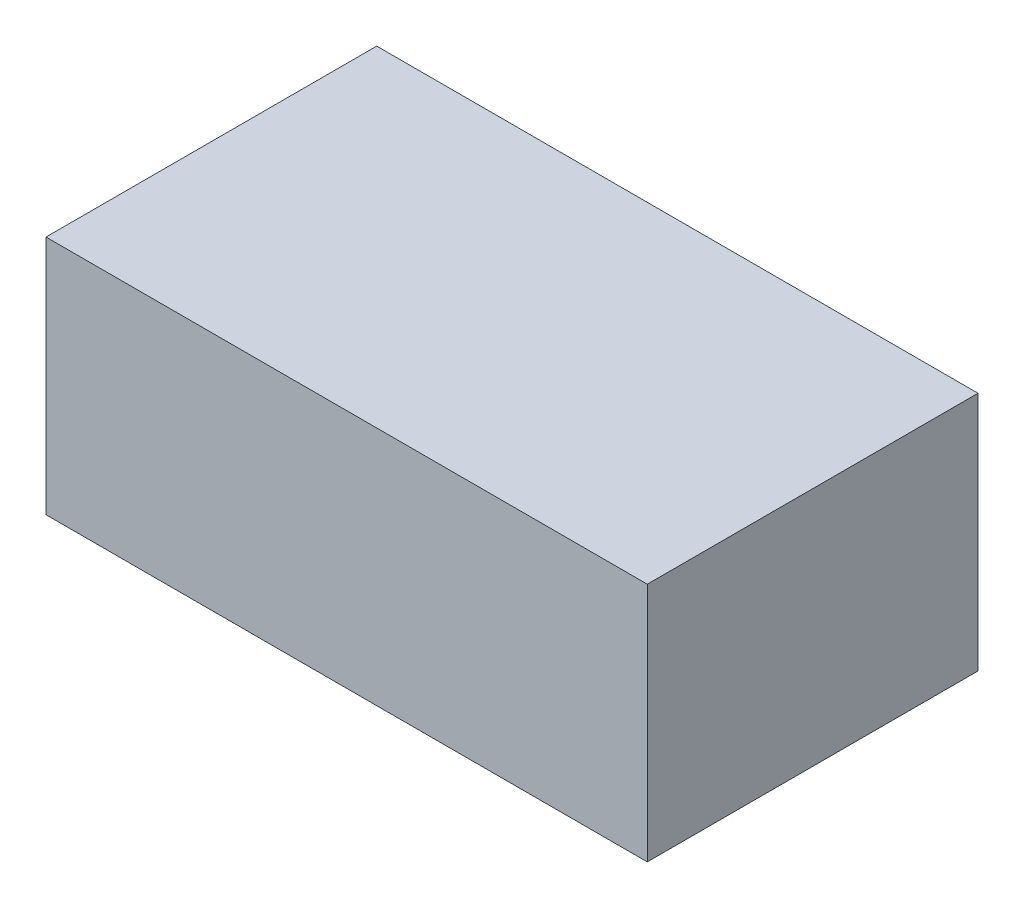
ISO-10303-21;
HEADER;
FILE_DESCRIPTION(('STEP AP214'),'2;1');
FILE_NAME('part.step','',(''),(''),'','','');
FILE_SCHEMA(('AUTOMOTIVE_DESIGN { 1 0 10303 214 1 1 1 1 }'));
ENDSEC;
DATA;
#1=APPLICATION_CONTEXT('core data for automotive mechanical design processes');
#2=APPLICATION_PROTOCOL_DEFINITION('international standard','automotive_design',2000,#1);
#3=PRODUCT_CONTEXT('',#1,'mechanical');
#4=PRODUCT('Part','Part','',(#3));
#5=PRODUCT_RELATED_PRODUCT_CATEGORY('part','',(#4));
#6=PRODUCT_DEFINITION_FORMATION('','',#4);
#7=PRODUCT_DEFINITION_CONTEXT('part definition',#1,'design');
#8=PRODUCT_DEFINITION('design','',#6,#7);
#9=PRODUCT_DEFINITION_SHAPE('','',#8);
#10=(LENGTH_UNIT() NAMED_UNIT(*) SI_UNIT(.MILLI.,.METRE.));
#11=(NAMED_UNIT(*) PLANE_ANGLE_UNIT() SI_UNIT($,.RADIAN.));
#12=(NAMED_UNIT(*) SI_UNIT($,.STERADIAN.) SOLID_ANGLE_UNIT());
#13=UNCERTAINTY_MEASURE_WITH_UNIT(LENGTH_MEASURE(1.E-05),#10,'distance_accuracy_value','');
#14=(GEOMETRIC_REPRESENTATION_CONTEXT(3) GLOBAL_UNCERTAINTY_ASSIGNED_CONTEXT((#13)) GLOBAL_UNIT_ASSIGNED_CONTEXT((#10,
#11,#12)) REPRESENTATION_CONTEXT('',''));
#15=CARTESIAN_POINT('',(0.,0.,0.));
#16=DIRECTION('',(0.,0.,1.));
#17=DIRECTION('',(1.,0.,0.));
#18=AXIS2_PLACEMENT_3D('',#15,#16,#17);
#19=CARTESIAN_POINT('',(-2.00000108,-0.80000094,0.));
#20=DIRECTION('',(0.,1.,0.));
#21=DIRECTION('',(0.,0.,1.));
#22=AXIS2_PLACEMENT_3D('',#19,#20,#21);
#23=PLANE('',#22);
#24=DIRECTION('',(0.,0.,1.));
#25=VECTOR('',#24,1.);
#26=CARTESIAN_POINT('',(2.00000108,-0.80000094,0.));
#27=LINE('',#26,#25);
#28=CARTESIAN_POINT('',(2.00000108,-0.80000094,0.));
#29=VERTEX_POINT('',#28);
#30=CARTESIAN_POINT('',(2.00000108,-0.80000094,2.20000068));
#31=VERTEX_POINT('',#30);
#32=EDGE_CURVE('E20',#29,#31,#27,.T.);
#33=ORIENTED_EDGE('',*,*,#32,.T.);
#34=DIRECTION('',(-1.,0.,0.));
#35=VECTOR('',#34,1.);
#36=CARTESIAN_POINT('',(2.00000108,-0.80000094,2.20000068));
#37=LINE('',#36,#35);
#38=CARTESIAN_POINT('',(-2.00000108,-0.80000094,2.20000068));
#39=VERTEX_POINT('',#38);
#40=EDGE_CURVE('E55',#31,#39,#37,.T.);
#41=ORIENTED_EDGE('',*,*,#40,.T.);
#42=DIRECTION('',(0.,0.,-1.));
#43=VECTOR('',#42,1.);
#44=CARTESIAN_POINT('',(-2.00000108,-0.80000094,0.));
#45=LINE('',#44,#43);
#46=CARTESIAN_POINT('',(-2.00000108,-0.80000094,0.));
#47=VERTEX_POINT('',#46);
#48=EDGE_CURVE('E74',#39,#47,#45,.T.);
#49=ORIENTED_EDGE('',*,*,#48,.T.);
#50=DIRECTION('',(-1.,0.,0.));
#51=VECTOR('',#50,1.);
#52=CARTESIAN_POINT('',(2.00000108,-0.80000094,0.));
#53=LINE('',#52,#51);
#54=EDGE_CURVE('E66',#29,#47,#53,.T.);
#55=ORIENTED_EDGE('',*,*,#54,.F.);
#56=EDGE_LOOP('',(#33,#41,#49,#55));
#57=FACE_BOUND('',#56,.T.);
#58=ADVANCED_FACE('F17',(#57),#23,.F.);
#59=CARTESIAN_POINT('',(2.00000108,-0.80000094,0.));
#60=DIRECTION('',(-1.,0.,0.));
#61=DIRECTION('',(0.,0.,1.));
#62=AXIS2_PLACEMENT_3D('',#59,#60,#61);
#63=PLANE('',#62);
#64=DIRECTION('',(0.,0.,-1.));
#65=VECTOR('',#64,1.);
#66=CARTESIAN_POINT('',(2.00000108,0.80000094,0.));
#67=LINE('',#66,#65);
#68=CARTESIAN_POINT('',(2.00000108,0.80000094,0.));
#69=VERTEX_POINT('',#68);
#70=CARTESIAN_POINT('',(2.00000108,0.80000094,2.20000068));
#71=VERTEX_POINT('',#70);
#72=EDGE_CURVE('E72',#69,#71,#67,.F.);
#73=ORIENTED_EDGE('',*,*,#72,.T.);
#74=DIRECTION('',(0.,1.,0.));
#75=VECTOR('',#74,1.);
#76=CARTESIAN_POINT('',(2.00000108,-0.80000094,2.20000068));
#77=LINE('',#76,#75);
#78=EDGE_CURVE('E62',#71,#31,#77,.F.);
#79=ORIENTED_EDGE('',*,*,#78,.T.);
#80=ORIENTED_EDGE('',*,*,#32,.F.);
#81=DIRECTION('',(0.,1.,0.));
#82=VECTOR('',#81,1.);
#83=CARTESIAN_POINT('',(2.00000108,-0.80000094,0.));
#84=LINE('',#83,#82);
#85=EDGE_CURVE('E80',#69,#29,#84,.F.);
#86=ORIENTED_EDGE('',*,*,#85,.F.);
#87=EDGE_LOOP('',(#73,#79,#80,#86));
#88=FACE_BOUND('',#87,.T.);
#89=ADVANCED_FACE('F71',(#88),#63,.F.);
#90=CARTESIAN_POINT('',(2.00000108,-0.80000094,2.20000068));
#91=DIRECTION('',(0.,0.,-1.));
#92=DIRECTION('',(-1.,0.,0.));
#93=AXIS2_PLACEMENT_3D('',#90,#91,#92);
#94=PLANE('',#93);
#95=DIRECTION('',(1.,0.,0.));
#96=VECTOR('',#95,1.);
#97=CARTESIAN_POINT('',(2.00000108,0.80000094,2.20000068));
#98=LINE('',#97,#96);
#99=CARTESIAN_POINT('',(-2.00000108,0.80000094,2.20000068));
#100=VERTEX_POINT('',#99);
#101=EDGE_CURVE('E83',#71,#100,#98,.F.);
#102=ORIENTED_EDGE('',*,*,#101,.T.);
#103=DIRECTION('',(0.,1.,0.));
#104=VECTOR('',#103,1.);
#105=CARTESIAN_POINT('',(-2.00000108,0.80000094,2.20000068));
#106=LINE('',#105,#104);
#107=EDGE_CURVE('E64',#100,#39,#106,.F.);
#108=ORIENTED_EDGE('',*,*,#107,.T.);
#109=ORIENTED_EDGE('',*,*,#40,.F.);
#110=ORIENTED_EDGE('',*,*,#78,.F.);
#111=EDGE_LOOP('',(#102,#108,#109,#110));
#112=FACE_BOUND('',#111,.T.);
#113=ADVANCED_FACE('F60',(#112),#94,.F.);
#114=CARTESIAN_POINT('',(-2.00000108,0.80000094,0.));
#115=DIRECTION('',(1.,0.,0.));
#116=DIRECTION('',(0.,0.,-1.));
#117=AXIS2_PLACEMENT_3D('',#114,#115,#116);
#118=PLANE('',#117);
#119=ORIENTED_EDGE('',*,*,#48,.F.);
#120=ORIENTED_EDGE('',*,*,#107,.F.);
#121=DIRECTION('',(0.,0.,-1.));
#122=VECTOR('',#121,1.);
#123=CARTESIAN_POINT('',(-2.00000108,0.80000094,0.));
#124=LINE('',#123,#122);
#125=CARTESIAN_POINT('',(-2.00000108,0.80000094,0.));
#126=VERTEX_POINT('',#125);
#127=EDGE_CURVE('E26',#100,#126,#124,.T.);
#128=ORIENTED_EDGE('',*,*,#127,.T.);
#129=DIRECTION('',(0.,1.,0.));
#130=VECTOR('',#129,1.);
#131=CARTESIAN_POINT('',(-2.00000108,-0.80000094,0.));
#132=LINE('',#131,#130);
#133=EDGE_CURVE('E34',#47,#126,#132,.T.);
#134=ORIENTED_EDGE('',*,*,#133,.F.);
#135=EDGE_LOOP('',(#119,#120,#128,#134));
#136=FACE_BOUND('',#135,.T.);
#137=ADVANCED_FACE('F88',(#136),#118,.F.);
#138=CARTESIAN_POINT('',(2.00000108,-0.80000094,0.));
#139=DIRECTION('',(0.,0.,-1.));
#140=DIRECTION('',(-1.,0.,0.));
#141=AXIS2_PLACEMENT_3D('',#138,#139,#140);
#142=PLANE('',#141);
#143=DIRECTION('',(1.,0.,0.));
#144=VECTOR('',#143,1.);
#145=CARTESIAN_POINT('',(2.00000108,0.80000094,0.));
#146=LINE('',#145,#144);
#147=EDGE_CURVE('E11',#126,#69,#146,.T.);
#148=ORIENTED_EDGE('',*,*,#147,.T.);
#149=ORIENTED_EDGE('',*,*,#85,.T.);
#150=ORIENTED_EDGE('',*,*,#54,.T.);
#151=ORIENTED_EDGE('',*,*,#133,.T.);
#152=EDGE_LOOP('',(#148,#149,#150,#151));
#153=FACE_BOUND('',#152,.T.);
#154=ADVANCED_FACE('F91',(#153),#142,.T.);
#155=CARTESIAN_POINT('',(2.00000108,0.80000094,0.));
#156=DIRECTION('',(0.,-1.,0.));
#157=DIRECTION('',(0.,0.,-1.));
#158=AXIS2_PLACEMENT_3D('',#155,#156,#157);
#159=PLANE('',#158);
#160=ORIENTED_EDGE('',*,*,#127,.F.);
#161=ORIENTED_EDGE('',*,*,#101,.F.);
#162=ORIENTED_EDGE('',*,*,#72,.F.);
#163=ORIENTED_EDGE('',*,*,#147,.F.);
#164=EDGE_LOOP('',(#160,#161,#162,#163));
#165=FACE_BOUND('',#164,.T.);
#166=ADVANCED_FACE('F90',(#165),#159,.F.);
#167=CLOSED_SHELL('',(#58,#89,#113,#137,#154,#166));
#168=MANIFOLD_SOLID_BREP('B1',#167);
#169=ADVANCED_BREP_SHAPE_REPRESENTATION('',(#18,#168),#14);
#170=SHAPE_DEFINITION_REPRESENTATION(#9,#169);
ENDSEC;
END-ISO-10303-21;
